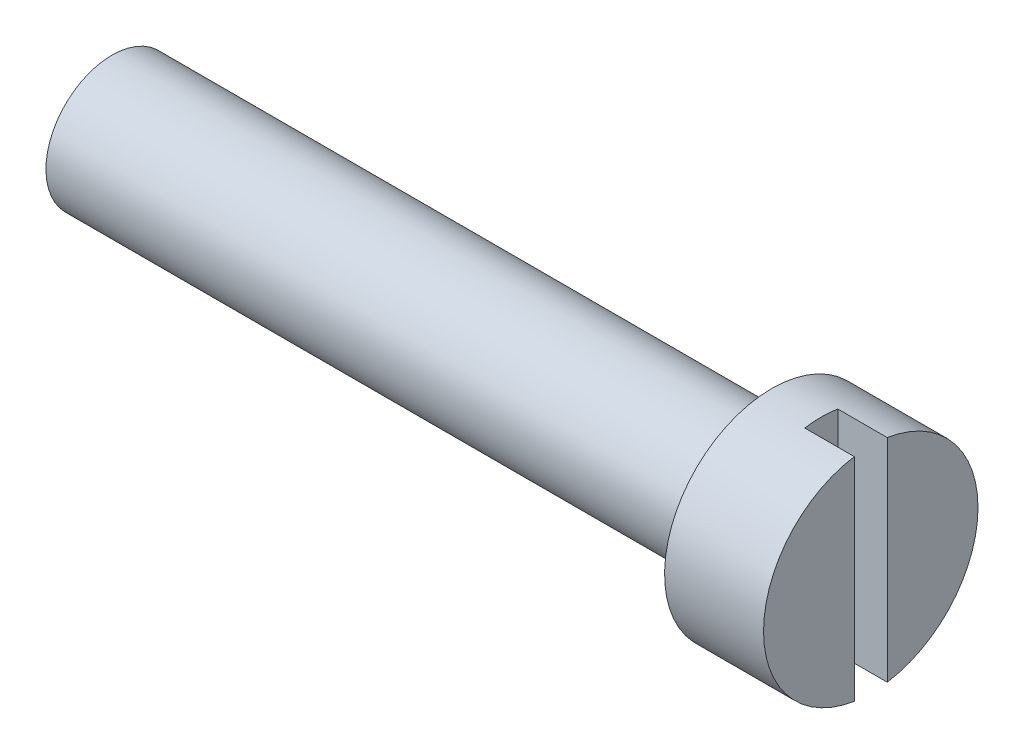
ISO-10303-21;
HEADER;
FILE_DESCRIPTION(('STEP AP214'),'2;1');
FILE_NAME('part.step','',(''),(''),'','','');
FILE_SCHEMA(('AUTOMOTIVE_DESIGN { 1 0 10303 214 1 1 1 1 }'));
ENDSEC;
DATA;
#1=APPLICATION_CONTEXT('core data for automotive mechanical design processes');
#2=APPLICATION_PROTOCOL_DEFINITION('international standard','automotive_design',2000,#1);
#3=PRODUCT_CONTEXT('',#1,'mechanical');
#4=PRODUCT('Part','Part','',(#3));
#5=PRODUCT_RELATED_PRODUCT_CATEGORY('part','',(#4));
#6=PRODUCT_DEFINITION_FORMATION('','',#4);
#7=PRODUCT_DEFINITION_CONTEXT('part definition',#1,'design');
#8=PRODUCT_DEFINITION('design','',#6,#7);
#9=PRODUCT_DEFINITION_SHAPE('','',#8);
#10=(LENGTH_UNIT() NAMED_UNIT(*) SI_UNIT(.MILLI.,.METRE.));
#11=(NAMED_UNIT(*) PLANE_ANGLE_UNIT() SI_UNIT($,.RADIAN.));
#12=(NAMED_UNIT(*) SI_UNIT($,.STERADIAN.) SOLID_ANGLE_UNIT());
#13=UNCERTAINTY_MEASURE_WITH_UNIT(LENGTH_MEASURE(1.E-05),#10,'distance_accuracy_value','');
#14=(GEOMETRIC_REPRESENTATION_CONTEXT(3) GLOBAL_UNCERTAINTY_ASSIGNED_CONTEXT((#13)) GLOBAL_UNIT_ASSIGNED_CONTEXT((#10,
#11,#12)) REPRESENTATION_CONTEXT('',''));
#15=CARTESIAN_POINT('',(0.,0.,0.));
#16=DIRECTION('',(0.,0.,1.));
#17=DIRECTION('',(1.,0.,0.));
#18=AXIS2_PLACEMENT_3D('',#15,#16,#17);
#19=CARTESIAN_POINT('',(0.,3.25,0.));
#20=DIRECTION('',(1.,0.,0.));
#21=DIRECTION('',(0.,1.,0.));
#22=AXIS2_PLACEMENT_3D('',#19,#20,#21);
#23=PLANE('',#22);
#24=DIRECTION('',(0.,1.,0.));
#25=VECTOR('',#24,1.);
#26=CARTESIAN_POINT('',(0.,-3.25,-0.5));
#27=LINE('',#26,#25);
#28=CARTESIAN_POINT('',(0.,-3.21130814466628,-0.5));
#29=VERTEX_POINT('',#28);
#30=CARTESIAN_POINT('',(0.,3.21130814466628,-0.5));
#31=VERTEX_POINT('',#30);
#32=EDGE_CURVE('E79',#29,#31,#27,.T.);
#33=ORIENTED_EDGE('',*,*,#32,.F.);
#34=CARTESIAN_POINT('',(0.,0.,0.));
#35=DIRECTION('',(1.,0.,0.));
#36=DIRECTION('',(0.,1.,0.));
#37=AXIS2_PLACEMENT_3D('',#34,#35,#36);
#38=CIRCLE('',#37,3.25);
#39=EDGE_CURVE('E89',#29,#31,#38,.T.);
#40=ORIENTED_EDGE('',*,*,#39,.T.);
#41=EDGE_LOOP('',(#33,#40));
#42=FACE_BOUND('',#41,.T.);
#43=ADVANCED_FACE('F37',(#42),#23,.T.);
#44=DIRECTION('',(0.,-1.,0.));
#45=VECTOR('',#44,1.);
#46=CARTESIAN_POINT('',(0.,-3.25,0.5));
#47=LINE('',#46,#45);
#48=CARTESIAN_POINT('',(0.,3.21130814466628,0.5));
#49=VERTEX_POINT('',#48);
#50=CARTESIAN_POINT('',(0.,-3.21130814466628,0.5));
#51=VERTEX_POINT('',#50);
#52=EDGE_CURVE('E90',#49,#51,#47,.T.);
#53=ORIENTED_EDGE('',*,*,#52,.F.);
#54=EDGE_CURVE('E94',#49,#51,#38,.T.);
#55=ORIENTED_EDGE('',*,*,#54,.T.);
#56=EDGE_LOOP('',(#53,#55));
#57=FACE_BOUND('',#56,.T.);
#58=ADVANCED_FACE('F39',(#57),#23,.T.);
#59=CARTESIAN_POINT('',(-23.,0.,0.));
#60=DIRECTION('',(-1.,0.,0.));
#61=DIRECTION('',(0.,-1.,0.));
#62=AXIS2_PLACEMENT_3D('',#59,#60,#61);
#63=PLANE('',#62);
#64=CARTESIAN_POINT('',(-23.,0.,0.));
#65=DIRECTION('',(1.,0.,0.));
#66=DIRECTION('',(0.,1.,0.));
#67=AXIS2_PLACEMENT_3D('',#64,#65,#66);
#68=CIRCLE('',#67,2.);
#69=CARTESIAN_POINT('',(-23.,2.,0.));
#70=VERTEX_POINT('',#69);
#71=EDGE_CURVE('E106',#70,#70,#68,.T.);
#72=ORIENTED_EDGE('',*,*,#71,.F.);
#73=EDGE_LOOP('',(#72));
#74=FACE_BOUND('',#73,.T.);
#75=ADVANCED_FACE('F131',(#74),#63,.T.);
#76=CARTESIAN_POINT('',(0.,0.,0.));
#77=DIRECTION('',(1.,0.,0.));
#78=DIRECTION('',(0.,1.,0.));
#79=AXIS2_PLACEMENT_3D('',#76,#77,#78);
#80=CYLINDRICAL_SURFACE('',#79,2.);
#81=ORIENTED_EDGE('',*,*,#71,.T.);
#82=EDGE_LOOP('',(#81));
#83=FACE_BOUND('',#82,.T.);
#84=CARTESIAN_POINT('',(-3.,0.,0.));
#85=DIRECTION('',(1.,0.,0.));
#86=DIRECTION('',(0.,1.,0.));
#87=AXIS2_PLACEMENT_3D('',#84,#85,#86);
#88=CIRCLE('',#87,2.);
#89=CARTESIAN_POINT('',(-3.,2.,0.));
#90=VERTEX_POINT('',#89);
#91=EDGE_CURVE('E103',#90,#90,#88,.T.);
#92=ORIENTED_EDGE('',*,*,#91,.F.);
#93=EDGE_LOOP('',(#92));
#94=FACE_BOUND('',#93,.T.);
#95=ADVANCED_FACE('F136',(#83,#94),#80,.T.);
#96=CARTESIAN_POINT('',(-3.,2.,0.));
#97=DIRECTION('',(-1.,0.,0.));
#98=DIRECTION('',(0.,-1.,0.));
#99=AXIS2_PLACEMENT_3D('',#96,#97,#98);
#100=PLANE('',#99);
#101=ORIENTED_EDGE('',*,*,#91,.T.);
#102=EDGE_LOOP('',(#101));
#103=FACE_BOUND('',#102,.T.);
#104=CARTESIAN_POINT('',(-3.,0.,0.));
#105=DIRECTION('',(1.,0.,0.));
#106=DIRECTION('',(0.,1.,0.));
#107=AXIS2_PLACEMENT_3D('',#104,#105,#106);
#108=CIRCLE('',#107,3.25);
#109=CARTESIAN_POINT('',(-3.,3.25,0.));
#110=VERTEX_POINT('',#109);
#111=EDGE_CURVE('E97',#110,#110,#108,.T.);
#112=ORIENTED_EDGE('',*,*,#111,.F.);
#113=EDGE_LOOP('',(#112));
#114=FACE_BOUND('',#113,.T.);
#115=ADVANCED_FACE('F141',(#103,#114),#100,.T.);
#116=CARTESIAN_POINT('',(0.,0.,0.));
#117=DIRECTION('',(1.,0.,0.));
#118=DIRECTION('',(0.,1.,0.));
#119=AXIS2_PLACEMENT_3D('',#116,#117,#118);
#120=CYLINDRICAL_SURFACE('',#119,3.25);
#121=DIRECTION('',(1.,0.,0.));
#122=VECTOR('',#121,1.);
#123=CARTESIAN_POINT('',(0.,3.21130814466628,-0.5));
#124=LINE('',#123,#122);
#125=CARTESIAN_POINT('',(-1.5,3.21130814466628,-0.5));
#126=VERTEX_POINT('',#125);
#127=EDGE_CURVE('E11',#31,#126,#124,.F.);
#128=ORIENTED_EDGE('',*,*,#127,.F.);
#129=ORIENTED_EDGE('',*,*,#39,.F.);
#130=DIRECTION('',(1.,0.,0.));
#131=VECTOR('',#130,1.);
#132=CARTESIAN_POINT('',(0.,-3.21130814466628,-0.5));
#133=LINE('',#132,#131);
#134=CARTESIAN_POINT('',(-1.5,-3.21130814466628,-0.5));
#135=VERTEX_POINT('',#134);
#136=EDGE_CURVE('E76',#135,#29,#133,.T.);
#137=ORIENTED_EDGE('',*,*,#136,.F.);
#138=CARTESIAN_POINT('',(-1.5,0.,0.));
#139=DIRECTION('',(-1.,0.,0.));
#140=DIRECTION('',(0.,-1.,0.));
#141=AXIS2_PLACEMENT_3D('',#138,#139,#140);
#142=CIRCLE('',#141,3.25);
#143=CARTESIAN_POINT('',(-1.5,-3.21130814466628,0.5));
#144=VERTEX_POINT('',#143);
#145=EDGE_CURVE('E109',#144,#135,#142,.F.);
#146=ORIENTED_EDGE('',*,*,#145,.F.);
#147=DIRECTION('',(1.,0.,0.));
#148=VECTOR('',#147,1.);
#149=CARTESIAN_POINT('',(0.,-3.21130814466628,0.5));
#150=LINE('',#149,#148);
#151=EDGE_CURVE('E85',#51,#144,#150,.F.);
#152=ORIENTED_EDGE('',*,*,#151,.F.);
#153=ORIENTED_EDGE('',*,*,#54,.F.);
#154=DIRECTION('',(1.,0.,0.));
#155=VECTOR('',#154,1.);
#156=CARTESIAN_POINT('',(0.,3.21130814466628,0.5));
#157=LINE('',#156,#155);
#158=CARTESIAN_POINT('',(-1.5,3.21130814466628,0.5));
#159=VERTEX_POINT('',#158);
#160=EDGE_CURVE('E45',#159,#49,#157,.T.);
#161=ORIENTED_EDGE('',*,*,#160,.F.);
#162=EDGE_CURVE('E57',#126,#159,#142,.F.);
#163=ORIENTED_EDGE('',*,*,#162,.F.);
#164=EDGE_LOOP('',(#128,#129,#137,#146,#152,#153,#161,#163));
#165=FACE_BOUND('',#164,.T.);
#166=ORIENTED_EDGE('',*,*,#111,.T.);
#167=EDGE_LOOP('',(#166));
#168=FACE_BOUND('',#167,.T.);
#169=ADVANCED_FACE('F92',(#165,#168),#120,.T.);
#170=CARTESIAN_POINT('',(-1.5,-3.25,-0.5));
#171=DIRECTION('',(0.,0.,-1.));
#172=DIRECTION('',(-1.,0.,0.));
#173=AXIS2_PLACEMENT_3D('',#170,#171,#172);
#174=PLANE('',#173);
#175=ORIENTED_EDGE('',*,*,#127,.T.);
#176=DIRECTION('',(0.,1.,0.));
#177=VECTOR('',#176,1.);
#178=CARTESIAN_POINT('',(-1.5,-3.25,-0.5));
#179=LINE('',#178,#177);
#180=EDGE_CURVE('E81',#135,#126,#179,.T.);
#181=ORIENTED_EDGE('',*,*,#180,.F.);
#182=ORIENTED_EDGE('',*,*,#136,.T.);
#183=ORIENTED_EDGE('',*,*,#32,.T.);
#184=EDGE_LOOP('',(#175,#181,#182,#183));
#185=FACE_BOUND('',#184,.T.);
#186=ADVANCED_FACE('F78',(#185),#174,.F.);
#187=CARTESIAN_POINT('',(-1.5,-3.25,0.5));
#188=DIRECTION('',(0.,0.,1.));
#189=DIRECTION('',(1.,0.,0.));
#190=AXIS2_PLACEMENT_3D('',#187,#188,#189);
#191=PLANE('',#190);
#192=ORIENTED_EDGE('',*,*,#151,.T.);
#193=DIRECTION('',(0.,-1.,0.));
#194=VECTOR('',#193,1.);
#195=CARTESIAN_POINT('',(-1.5,-3.25,0.5));
#196=LINE('',#195,#194);
#197=EDGE_CURVE('E52',#159,#144,#196,.T.);
#198=ORIENTED_EDGE('',*,*,#197,.F.);
#199=ORIENTED_EDGE('',*,*,#160,.T.);
#200=ORIENTED_EDGE('',*,*,#52,.T.);
#201=EDGE_LOOP('',(#192,#198,#199,#200));
#202=FACE_BOUND('',#201,.T.);
#203=ADVANCED_FACE('F114',(#202),#191,.F.);
#204=CARTESIAN_POINT('',(-1.5,0.,0.));
#205=DIRECTION('',(-1.,0.,0.));
#206=DIRECTION('',(0.,-1.,0.));
#207=AXIS2_PLACEMENT_3D('',#204,#205,#206);
#208=PLANE('',#207);
#209=ORIENTED_EDGE('',*,*,#180,.T.);
#210=ORIENTED_EDGE('',*,*,#162,.T.);
#211=ORIENTED_EDGE('',*,*,#197,.T.);
#212=ORIENTED_EDGE('',*,*,#145,.T.);
#213=EDGE_LOOP('',(#209,#210,#211,#212));
#214=FACE_BOUND('',#213,.T.);
#215=ADVANCED_FACE('F118',(#214),#208,.F.);
#216=CLOSED_SHELL('',(#43,#58,#75,#95,#115,#169,#186,#203,#215));
#217=MANIFOLD_SOLID_BREP('B2',#216);
#218=ADVANCED_BREP_SHAPE_REPRESENTATION('',(#18,#217),#14);
#219=SHAPE_DEFINITION_REPRESENTATION(#9,#218);
ENDSEC;
END-ISO-10303-21;
